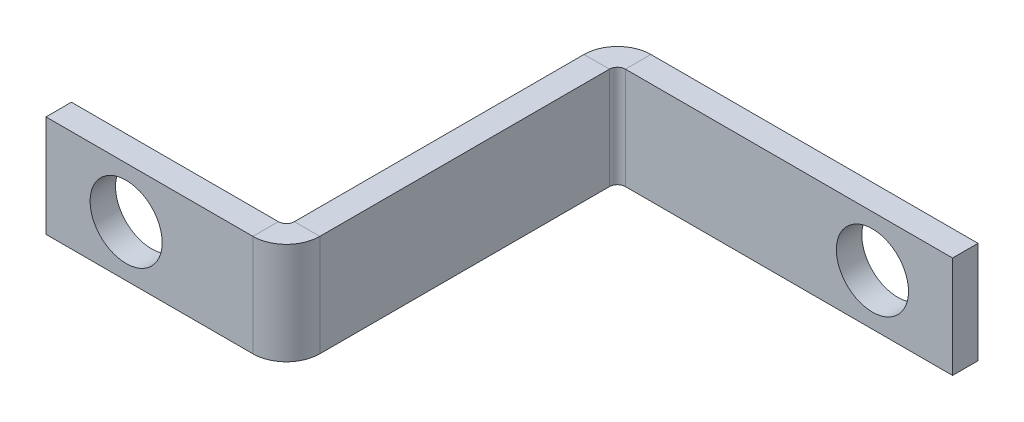
ISO-10303-21;
HEADER;
FILE_DESCRIPTION(('STEP AP214'),'2;1');
FILE_NAME('part.step','',(''),(''),'','','');
FILE_SCHEMA(('AUTOMOTIVE_DESIGN { 1 0 10303 214 1 1 1 1 }'));
ENDSEC;
DATA;
#1=APPLICATION_CONTEXT('core data for automotive mechanical design processes');
#2=APPLICATION_PROTOCOL_DEFINITION('international standard','automotive_design',2000,#1);
#3=PRODUCT_CONTEXT('',#1,'mechanical');
#4=PRODUCT('Part','Part','',(#3));
#5=PRODUCT_RELATED_PRODUCT_CATEGORY('part','',(#4));
#6=PRODUCT_DEFINITION_FORMATION('','',#4);
#7=PRODUCT_DEFINITION_CONTEXT('part definition',#1,'design');
#8=PRODUCT_DEFINITION('design','',#6,#7);
#9=PRODUCT_DEFINITION_SHAPE('','',#8);
#10=(LENGTH_UNIT() NAMED_UNIT(*) SI_UNIT(.MILLI.,.METRE.));
#11=(NAMED_UNIT(*) PLANE_ANGLE_UNIT() SI_UNIT($,.RADIAN.));
#12=(NAMED_UNIT(*) SI_UNIT($,.STERADIAN.) SOLID_ANGLE_UNIT());
#13=UNCERTAINTY_MEASURE_WITH_UNIT(LENGTH_MEASURE(1.E-05),#10,'distance_accuracy_value','');
#14=(GEOMETRIC_REPRESENTATION_CONTEXT(3) GLOBAL_UNCERTAINTY_ASSIGNED_CONTEXT((#13)) GLOBAL_UNIT_ASSIGNED_CONTEXT((#10,
#11,#12)) REPRESENTATION_CONTEXT('',''));
#15=CARTESIAN_POINT('',(0.,0.,0.));
#16=DIRECTION('',(0.,0.,1.));
#17=DIRECTION('',(1.,0.,0.));
#18=AXIS2_PLACEMENT_3D('',#15,#16,#17);
#19=CARTESIAN_POINT('',(30.0000000000001,0.,-41.32));
#20=DIRECTION('',(0.,1.,0.));
#21=DIRECTION('',(0.,0.,1.));
#22=AXIS2_PLACEMENT_3D('',#19,#20,#21);
#23=PLANE('',#22);
#24=DIRECTION('',(-1.,0.,0.));
#25=VECTOR('',#24,1.);
#26=CARTESIAN_POINT('',(30.0000000000001,0.,-37.145));
#27=LINE('',#26,#25);
#28=CARTESIAN_POINT('',(30.0000000000001,0.,-37.145));
#29=VERTEX_POINT('',#28);
#30=CARTESIAN_POINT('',(26.8250000000001,0.,-37.145));
#31=VERTEX_POINT('',#30);
#32=EDGE_CURVE('E228',#29,#31,#27,.T.);
#33=ORIENTED_EDGE('',*,*,#32,.F.);
#34=DIRECTION('',(0.,0.,-1.));
#35=VECTOR('',#34,1.);
#36=CARTESIAN_POINT('',(30.,0.,1.16881754302655E-13));
#37=LINE('',#36,#35);
#38=CARTESIAN_POINT('',(30.,0.,-0.999999999999986));
#39=VERTEX_POINT('',#38);
#40=EDGE_CURVE('E236',#39,#29,#37,.T.);
#41=ORIENTED_EDGE('',*,*,#40,.F.);
#42=DIRECTION('',(-1.,0.,0.));
#43=VECTOR('',#42,1.);
#44=CARTESIAN_POINT('',(26.825,0.,-0.999999999999997));
#45=LINE('',#44,#43);
#46=CARTESIAN_POINT('',(26.825,0.,-0.999999999999998));
#47=VERTEX_POINT('',#46);
#48=EDGE_CURVE('E247',#47,#39,#45,.F.);
#49=ORIENTED_EDGE('',*,*,#48,.F.);
#50=DIRECTION('',(0.,0.,1.));
#51=VECTOR('',#50,1.);
#52=CARTESIAN_POINT('',(26.8250000000001,0.,-41.32));
#53=LINE('',#52,#51);
#54=EDGE_CURVE('E241',#47,#31,#53,.F.);
#55=ORIENTED_EDGE('',*,*,#54,.T.);
#56=EDGE_LOOP('',(#33,#41,#49,#55));
#57=FACE_BOUND('',#56,.T.);
#58=ADVANCED_FACE('F78',(#57),#23,.F.);
#59=CARTESIAN_POINT('',(30.,12.7,0.));
#60=DIRECTION('',(0.,-1.,0.));
#61=DIRECTION('',(0.,0.,-1.));
#62=AXIS2_PLACEMENT_3D('',#59,#60,#61);
#63=PLANE('',#62);
#64=DIRECTION('',(-1.,0.,0.));
#65=VECTOR('',#64,1.);
#66=CARTESIAN_POINT('',(30.0000000000001,12.7,-37.145));
#67=LINE('',#66,#65);
#68=CARTESIAN_POINT('',(30.0000000000001,12.7,-37.145));
#69=VERTEX_POINT('',#68);
#70=CARTESIAN_POINT('',(26.8250000000001,12.7,-37.145));
#71=VERTEX_POINT('',#70);
#72=EDGE_CURVE('E217',#69,#71,#67,.T.);
#73=ORIENTED_EDGE('',*,*,#72,.T.);
#74=DIRECTION('',(0.,0.,-1.));
#75=VECTOR('',#74,1.);
#76=CARTESIAN_POINT('',(26.825,12.7,0.));
#77=LINE('',#76,#75);
#78=CARTESIAN_POINT('',(26.825,12.7,-0.999999999999998));
#79=VERTEX_POINT('',#78);
#80=EDGE_CURVE('E239',#71,#79,#77,.F.);
#81=ORIENTED_EDGE('',*,*,#80,.T.);
#82=DIRECTION('',(-1.,0.,0.));
#83=VECTOR('',#82,1.);
#84=CARTESIAN_POINT('',(30.,12.7,-0.999999999999986));
#85=LINE('',#84,#83);
#86=CARTESIAN_POINT('',(30.,12.7,-0.999999999999986));
#87=VERTEX_POINT('',#86);
#88=EDGE_CURVE('E230',#79,#87,#85,.F.);
#89=ORIENTED_EDGE('',*,*,#88,.T.);
#90=DIRECTION('',(0.,0.,1.));
#91=VECTOR('',#90,1.);
#92=CARTESIAN_POINT('',(30.,12.7,1.16881754302655E-13));
#93=LINE('',#92,#91);
#94=EDGE_CURVE('E233',#69,#87,#93,.T.);
#95=ORIENTED_EDGE('',*,*,#94,.F.);
#96=EDGE_LOOP('',(#73,#81,#89,#95));
#97=FACE_BOUND('',#96,.T.);
#98=ADVANCED_FACE('F328',(#97),#63,.F.);
#99=CARTESIAN_POINT('',(30.,0.,1.16881754302655E-13));
#100=DIRECTION('',(-1.,0.,0.));
#101=DIRECTION('',(0.,0.,1.));
#102=AXIS2_PLACEMENT_3D('',#99,#100,#101);
#103=PLANE('',#102);
#104=DIRECTION('',(0.,1.,0.));
#105=VECTOR('',#104,1.);
#106=CARTESIAN_POINT('',(30.0000000000001,12.7,-37.145));
#107=LINE('',#106,#105);
#108=EDGE_CURVE('E223',#69,#29,#107,.F.);
#109=ORIENTED_EDGE('',*,*,#108,.F.);
#110=ORIENTED_EDGE('',*,*,#94,.T.);
#111=DIRECTION('',(0.,-1.,0.));
#112=VECTOR('',#111,1.);
#113=CARTESIAN_POINT('',(30.,12.7,-0.999999999999986));
#114=LINE('',#113,#112);
#115=EDGE_CURVE('E244',#39,#87,#114,.F.);
#116=ORIENTED_EDGE('',*,*,#115,.F.);
#117=ORIENTED_EDGE('',*,*,#40,.T.);
#118=EDGE_LOOP('',(#109,#110,#116,#117));
#119=FACE_BOUND('',#118,.T.);
#120=ADVANCED_FACE('F318',(#119),#103,.F.);
#121=CARTESIAN_POINT('',(26.825,0.,1.05796301051828E-13));
#122=DIRECTION('',(-1.,0.,0.));
#123=DIRECTION('',(0.,0.,1.));
#124=AXIS2_PLACEMENT_3D('',#121,#122,#123);
#125=PLANE('',#124);
#126=ORIENTED_EDGE('',*,*,#80,.F.);
#127=DIRECTION('',(0.,1.,0.));
#128=VECTOR('',#127,1.);
#129=CARTESIAN_POINT('',(26.8250000000001,12.7,-37.145));
#130=LINE('',#129,#128);
#131=EDGE_CURVE('E212',#71,#31,#130,.F.);
#132=ORIENTED_EDGE('',*,*,#131,.T.);
#133=ORIENTED_EDGE('',*,*,#54,.F.);
#134=DIRECTION('',(0.,-1.,0.));
#135=VECTOR('',#134,1.);
#136=CARTESIAN_POINT('',(26.825,12.7,-0.999999999999997));
#137=LINE('',#136,#135);
#138=EDGE_CURVE('E250',#79,#47,#137,.T.);
#139=ORIENTED_EDGE('',*,*,#138,.F.);
#140=EDGE_LOOP('',(#126,#132,#133,#139));
#141=FACE_BOUND('',#140,.T.);
#142=ADVANCED_FACE('F311',(#141),#125,.T.);
#143=CARTESIAN_POINT('',(0.,0.,0.));
#144=DIRECTION('',(0.,1.,0.));
#145=DIRECTION('',(1.,0.,0.));
#146=AXIS2_PLACEMENT_3D('',#143,#144,#145);
#147=PLANE('',#146);
#148=DIRECTION('',(1.,0.,0.));
#149=VECTOR('',#148,1.);
#150=CARTESIAN_POINT('',(0.,0.,0.));
#151=LINE('',#150,#149);
#152=CARTESIAN_POINT('',(0.,0.,0.));
#153=VERTEX_POINT('',#152);
#154=CARTESIAN_POINT('',(25.825,0.,0.));
#155=VERTEX_POINT('',#154);
#156=EDGE_CURVE('E280',#153,#155,#151,.T.);
#157=ORIENTED_EDGE('',*,*,#156,.T.);
#158=DIRECTION('',(0.,0.,1.));
#159=VECTOR('',#158,1.);
#160=CARTESIAN_POINT('',(25.825,0.,0.));
#161=LINE('',#160,#159);
#162=CARTESIAN_POINT('',(25.825,0.,3.175));
#163=VERTEX_POINT('',#162);
#164=EDGE_CURVE('E260',#155,#163,#161,.T.);
#165=ORIENTED_EDGE('',*,*,#164,.T.);
#166=DIRECTION('',(-1.,0.,0.));
#167=VECTOR('',#166,1.);
#168=CARTESIAN_POINT('',(0.,0.,3.175));
#169=LINE('',#168,#167);
#170=CARTESIAN_POINT('',(0.,0.,3.175));
#171=VERTEX_POINT('',#170);
#172=EDGE_CURVE('E278',#171,#163,#169,.F.);
#173=ORIENTED_EDGE('',*,*,#172,.F.);
#174=DIRECTION('',(0.,0.,-1.));
#175=VECTOR('',#174,1.);
#176=CARTESIAN_POINT('',(0.,0.,0.));
#177=LINE('',#176,#175);
#178=EDGE_CURVE('E13',#171,#153,#177,.T.);
#179=ORIENTED_EDGE('',*,*,#178,.T.);
#180=EDGE_LOOP('',(#157,#165,#173,#179));
#181=FACE_BOUND('',#180,.T.);
#182=ADVANCED_FACE('F298',(#181),#147,.F.);
#183=CARTESIAN_POINT('',(0.,0.,0.));
#184=DIRECTION('',(0.,0.,-1.));
#185=DIRECTION('',(-1.,0.,0.));
#186=AXIS2_PLACEMENT_3D('',#183,#184,#185);
#187=PLANE('',#186);
#188=CARTESIAN_POINT('',(10.,6.35,0.));
#189=DIRECTION('',(0.,0.,-1.));
#190=DIRECTION('',(-1.,0.,0.));
#191=AXIS2_PLACEMENT_3D('',#188,#189,#190);
#192=CIRCLE('',#191,4.49999999999999);
#193=CARTESIAN_POINT('',(5.50000000000001,6.35,0.));
#194=VERTEX_POINT('',#193);
#195=EDGE_CURVE('E211',#194,#194,#192,.T.);
#196=ORIENTED_EDGE('',*,*,#195,.F.);
#197=EDGE_LOOP('',(#196));
#198=FACE_BOUND('',#197,.T.);
#199=DIRECTION('',(-1.,0.,0.));
#200=VECTOR('',#199,1.);
#201=CARTESIAN_POINT('',(0.,12.7,0.));
#202=LINE('',#201,#200);
#203=CARTESIAN_POINT('',(25.825,12.7,0.));
#204=VERTEX_POINT('',#203);
#205=CARTESIAN_POINT('',(0.,12.7,0.));
#206=VERTEX_POINT('',#205);
#207=EDGE_CURVE('E277',#204,#206,#202,.T.);
#208=ORIENTED_EDGE('',*,*,#207,.F.);
#209=DIRECTION('',(0.,-1.,0.));
#210=VECTOR('',#209,1.);
#211=CARTESIAN_POINT('',(25.825,0.,0.));
#212=LINE('',#211,#210);
#213=EDGE_CURVE('E103',#155,#204,#212,.F.);
#214=ORIENTED_EDGE('',*,*,#213,.F.);
#215=ORIENTED_EDGE('',*,*,#156,.F.);
#216=DIRECTION('',(0.,-1.,0.));
#217=VECTOR('',#216,1.);
#218=CARTESIAN_POINT('',(0.,0.,0.));
#219=LINE('',#218,#217);
#220=EDGE_CURVE('E274',#206,#153,#219,.T.);
#221=ORIENTED_EDGE('',*,*,#220,.F.);
#222=EDGE_LOOP('',(#208,#214,#215,#221));
#223=FACE_BOUND('',#222,.T.);
#224=ADVANCED_FACE('F295',(#198,#223),#187,.T.);
#225=CARTESIAN_POINT('',(0.,0.,3.175));
#226=DIRECTION('',(0.,0.,-1.));
#227=DIRECTION('',(-1.,0.,0.));
#228=AXIS2_PLACEMENT_3D('',#225,#226,#227);
#229=PLANE('',#228);
#230=CARTESIAN_POINT('',(10.,6.35,3.175));
#231=DIRECTION('',(0.,0.,-1.));
#232=DIRECTION('',(-1.,0.,0.));
#233=AXIS2_PLACEMENT_3D('',#230,#231,#232);
#234=CIRCLE('',#233,4.49999999999999);
#235=CARTESIAN_POINT('',(5.50000000000001,6.35,3.175));
#236=VERTEX_POINT('',#235);
#237=EDGE_CURVE('E346',#236,#236,#234,.T.);
#238=ORIENTED_EDGE('',*,*,#237,.T.);
#239=EDGE_LOOP('',(#238));
#240=FACE_BOUND('',#239,.T.);
#241=DIRECTION('',(0.,-1.,0.));
#242=VECTOR('',#241,1.);
#243=CARTESIAN_POINT('',(25.825,0.,3.175));
#244=LINE('',#243,#242);
#245=CARTESIAN_POINT('',(25.825,12.7,3.175));
#246=VERTEX_POINT('',#245);
#247=EDGE_CURVE('E254',#163,#246,#244,.F.);
#248=ORIENTED_EDGE('',*,*,#247,.T.);
#249=DIRECTION('',(-1.,0.,0.));
#250=VECTOR('',#249,1.);
#251=CARTESIAN_POINT('',(0.,12.7,3.175));
#252=LINE('',#251,#250);
#253=CARTESIAN_POINT('',(0.,12.7,3.175));
#254=VERTEX_POINT('',#253);
#255=EDGE_CURVE('E284',#246,#254,#252,.T.);
#256=ORIENTED_EDGE('',*,*,#255,.T.);
#257=DIRECTION('',(0.,1.,0.));
#258=VECTOR('',#257,1.);
#259=CARTESIAN_POINT('',(0.,0.,3.175));
#260=LINE('',#259,#258);
#261=EDGE_CURVE('E272',#254,#171,#260,.F.);
#262=ORIENTED_EDGE('',*,*,#261,.T.);
#263=ORIENTED_EDGE('',*,*,#172,.T.);
#264=EDGE_LOOP('',(#248,#256,#262,#263));
#265=FACE_BOUND('',#264,.T.);
#266=ADVANCED_FACE('F387',(#240,#265),#229,.F.);
#267=CARTESIAN_POINT('',(0.,0.,0.));
#268=DIRECTION('',(1.,0.,0.));
#269=DIRECTION('',(0.,-1.,0.));
#270=AXIS2_PLACEMENT_3D('',#267,#268,#269);
#271=PLANE('',#270);
#272=ORIENTED_EDGE('',*,*,#178,.F.);
#273=ORIENTED_EDGE('',*,*,#261,.F.);
#274=DIRECTION('',(0.,0.,-1.));
#275=VECTOR('',#274,1.);
#276=CARTESIAN_POINT('',(0.,12.7,0.));
#277=LINE('',#276,#275);
#278=EDGE_CURVE('E87',#254,#206,#277,.T.);
#279=ORIENTED_EDGE('',*,*,#278,.T.);
#280=ORIENTED_EDGE('',*,*,#220,.T.);
#281=EDGE_LOOP('',(#272,#273,#279,#280));
#282=FACE_BOUND('',#281,.T.);
#283=ADVANCED_FACE('F292',(#282),#271,.F.);
#284=CARTESIAN_POINT('',(0.,12.7,0.));
#285=DIRECTION('',(0.,-1.,0.));
#286=DIRECTION('',(-1.,0.,0.));
#287=AXIS2_PLACEMENT_3D('',#284,#285,#286);
#288=PLANE('',#287);
#289=DIRECTION('',(0.,0.,1.));
#290=VECTOR('',#289,1.);
#291=CARTESIAN_POINT('',(25.825,12.7,0.));
#292=LINE('',#291,#290);
#293=EDGE_CURVE('E269',#204,#246,#292,.T.);
#294=ORIENTED_EDGE('',*,*,#293,.F.);
#295=ORIENTED_EDGE('',*,*,#207,.T.);
#296=ORIENTED_EDGE('',*,*,#278,.F.);
#297=ORIENTED_EDGE('',*,*,#255,.F.);
#298=EDGE_LOOP('',(#294,#295,#296,#297));
#299=FACE_BOUND('',#298,.T.);
#300=ADVANCED_FACE('F80',(#299),#288,.F.);
#301=CARTESIAN_POINT('',(25.825,12.7,-1.));
#302=DIRECTION('',(0.,1.,0.));
#303=DIRECTION('',(0.,0.,1.));
#304=AXIS2_PLACEMENT_3D('',#301,#302,#303);
#305=PLANE('',#304);
#306=ORIENTED_EDGE('',*,*,#88,.F.);
#307=CARTESIAN_POINT('',(25.825,12.7,-1.));
#308=DIRECTION('',(0.,-1.,0.));
#309=DIRECTION('',(0.,0.,-1.));
#310=AXIS2_PLACEMENT_3D('',#307,#308,#309);
#311=CIRCLE('',#310,1.);
#312=EDGE_CURVE('E263',#204,#79,#311,.F.);
#313=ORIENTED_EDGE('',*,*,#312,.F.);
#314=ORIENTED_EDGE('',*,*,#293,.T.);
#315=CARTESIAN_POINT('',(25.825,12.7,-1.));
#316=DIRECTION('',(0.,-1.,0.));
#317=DIRECTION('',(0.,0.,-1.));
#318=AXIS2_PLACEMENT_3D('',#315,#316,#317);
#319=CIRCLE('',#318,4.175);
#320=EDGE_CURVE('E256',#246,#87,#319,.F.);
#321=ORIENTED_EDGE('',*,*,#320,.T.);
#322=EDGE_LOOP('',(#306,#313,#314,#321));
#323=FACE_BOUND('',#322,.T.);
#324=ADVANCED_FACE('F326',(#323),#305,.T.);
#325=CARTESIAN_POINT('',(25.825,0.,-1.));
#326=DIRECTION('',(0.,1.,0.));
#327=DIRECTION('',(0.,0.,1.));
#328=AXIS2_PLACEMENT_3D('',#325,#326,#327);
#329=PLANE('',#328);
#330=CARTESIAN_POINT('',(25.825,0.,-1.));
#331=DIRECTION('',(0.,-1.,0.));
#332=DIRECTION('',(0.,0.,-1.));
#333=AXIS2_PLACEMENT_3D('',#330,#331,#332);
#334=CIRCLE('',#333,1.);
#335=EDGE_CURVE('E235',#47,#155,#334,.T.);
#336=ORIENTED_EDGE('',*,*,#335,.F.);
#337=ORIENTED_EDGE('',*,*,#48,.T.);
#338=CARTESIAN_POINT('',(25.825,0.,-1.));
#339=DIRECTION('',(0.,-1.,0.));
#340=DIRECTION('',(0.,0.,-1.));
#341=AXIS2_PLACEMENT_3D('',#338,#339,#340);
#342=CIRCLE('',#341,4.175);
#343=EDGE_CURVE('E257',#39,#163,#342,.T.);
#344=ORIENTED_EDGE('',*,*,#343,.T.);
#345=ORIENTED_EDGE('',*,*,#164,.F.);
#346=EDGE_LOOP('',(#336,#337,#344,#345));
#347=FACE_BOUND('',#346,.T.);
#348=ADVANCED_FACE('F302',(#347),#329,.F.);
#349=CARTESIAN_POINT('',(25.825,0.,-1.));
#350=DIRECTION('',(0.,-1.,0.));
#351=DIRECTION('',(1.,0.,0.));
#352=AXIS2_PLACEMENT_3D('',#349,#350,#351);
#353=CYLINDRICAL_SURFACE('',#352,4.175);
#354=ORIENTED_EDGE('',*,*,#247,.F.);
#355=ORIENTED_EDGE('',*,*,#343,.F.);
#356=ORIENTED_EDGE('',*,*,#115,.T.);
#357=ORIENTED_EDGE('',*,*,#320,.F.);
#358=EDGE_LOOP('',(#354,#355,#356,#357));
#359=FACE_BOUND('',#358,.T.);
#360=ADVANCED_FACE('F323',(#359),#353,.T.);
#361=CARTESIAN_POINT('',(25.825,0.,-1.));
#362=DIRECTION('',(0.,-1.,0.));
#363=DIRECTION('',(1.,0.,0.));
#364=AXIS2_PLACEMENT_3D('',#361,#362,#363);
#365=CYLINDRICAL_SURFACE('',#364,1.);
#366=ORIENTED_EDGE('',*,*,#213,.T.);
#367=ORIENTED_EDGE('',*,*,#312,.T.);
#368=ORIENTED_EDGE('',*,*,#138,.T.);
#369=ORIENTED_EDGE('',*,*,#335,.T.);
#370=EDGE_LOOP('',(#366,#367,#368,#369));
#371=FACE_BOUND('',#370,.T.);
#372=ADVANCED_FACE('F305',(#371),#365,.F.);
#373=CARTESIAN_POINT('',(31.0000000000001,0.,-37.145));
#374=DIRECTION('',(0.,-1.,0.));
#375=DIRECTION('',(0.,0.,-1.));
#376=AXIS2_PLACEMENT_3D('',#373,#374,#375);
#377=PLANE('',#376);
#378=DIRECTION('',(0.,0.,1.));
#379=VECTOR('',#378,1.);
#380=CARTESIAN_POINT('',(31.0000000000001,0.,-41.32));
#381=LINE('',#380,#379);
#382=CARTESIAN_POINT('',(31.0000000000001,0.,-38.145));
#383=VERTEX_POINT('',#382);
#384=CARTESIAN_POINT('',(31.0000000000001,0.,-41.32));
#385=VERTEX_POINT('',#384);
#386=EDGE_CURVE('E194',#383,#385,#381,.F.);
#387=ORIENTED_EDGE('',*,*,#386,.F.);
#388=CARTESIAN_POINT('',(31.0000000000001,0.,-37.145));
#389=DIRECTION('',(0.,1.,0.));
#390=DIRECTION('',(0.,0.,1.));
#391=AXIS2_PLACEMENT_3D('',#388,#389,#390);
#392=CIRCLE('',#391,1.);
#393=EDGE_CURVE('E220',#29,#383,#392,.F.);
#394=ORIENTED_EDGE('',*,*,#393,.F.);
#395=ORIENTED_EDGE('',*,*,#32,.T.);
#396=CARTESIAN_POINT('',(31.0000000000001,0.,-37.145));
#397=DIRECTION('',(0.,1.,0.));
#398=DIRECTION('',(0.,0.,1.));
#399=AXIS2_PLACEMENT_3D('',#396,#397,#398);
#400=CIRCLE('',#399,4.175);
#401=EDGE_CURVE('E95',#31,#385,#400,.F.);
#402=ORIENTED_EDGE('',*,*,#401,.T.);
#403=EDGE_LOOP('',(#387,#394,#395,#402));
#404=FACE_BOUND('',#403,.T.);
#405=ADVANCED_FACE('F380',(#404),#377,.T.);
#406=CARTESIAN_POINT('',(31.0000000000001,12.7,-37.145));
#407=DIRECTION('',(0.,-1.,0.));
#408=DIRECTION('',(0.,0.,-1.));
#409=AXIS2_PLACEMENT_3D('',#406,#407,#408);
#410=PLANE('',#409);
#411=CARTESIAN_POINT('',(31.0000000000001,12.7,-37.145));
#412=DIRECTION('',(0.,1.,0.));
#413=DIRECTION('',(0.,0.,1.));
#414=AXIS2_PLACEMENT_3D('',#411,#412,#413);
#415=CIRCLE('',#414,1.);
#416=CARTESIAN_POINT('',(31.0000000000001,12.7,-38.145));
#417=VERTEX_POINT('',#416);
#418=EDGE_CURVE('E225',#417,#69,#415,.T.);
#419=ORIENTED_EDGE('',*,*,#418,.F.);
#420=DIRECTION('',(0.,0.,1.));
#421=VECTOR('',#420,1.);
#422=CARTESIAN_POINT('',(31.0000000000001,12.7,-38.145));
#423=LINE('',#422,#421);
#424=CARTESIAN_POINT('',(31.0000000000001,12.7,-41.32));
#425=VERTEX_POINT('',#424);
#426=EDGE_CURVE('E205',#417,#425,#423,.F.);
#427=ORIENTED_EDGE('',*,*,#426,.T.);
#428=CARTESIAN_POINT('',(31.0000000000001,12.7,-37.145));
#429=DIRECTION('',(0.,1.,0.));
#430=DIRECTION('',(0.,0.,1.));
#431=AXIS2_PLACEMENT_3D('',#428,#429,#430);
#432=CIRCLE('',#431,4.175);
#433=EDGE_CURVE('E215',#425,#71,#432,.T.);
#434=ORIENTED_EDGE('',*,*,#433,.T.);
#435=ORIENTED_EDGE('',*,*,#72,.F.);
#436=EDGE_LOOP('',(#419,#427,#434,#435));
#437=FACE_BOUND('',#436,.T.);
#438=ADVANCED_FACE('F331',(#437),#410,.F.);
#439=CARTESIAN_POINT('',(31.0000000000001,12.7,-37.145));
#440=DIRECTION('',(0.,1.,0.));
#441=DIRECTION('',(0.,0.,-1.));
#442=AXIS2_PLACEMENT_3D('',#439,#440,#441);
#443=CYLINDRICAL_SURFACE('',#442,4.175);
#444=ORIENTED_EDGE('',*,*,#131,.F.);
#445=ORIENTED_EDGE('',*,*,#433,.F.);
#446=DIRECTION('',(0.,1.,0.));
#447=VECTOR('',#446,1.);
#448=CARTESIAN_POINT('',(31.0000000000001,0.,-41.32));
#449=LINE('',#448,#447);
#450=EDGE_CURVE('E203',#425,#385,#449,.F.);
#451=ORIENTED_EDGE('',*,*,#450,.T.);
#452=ORIENTED_EDGE('',*,*,#401,.F.);
#453=EDGE_LOOP('',(#444,#445,#451,#452));
#454=FACE_BOUND('',#453,.T.);
#455=ADVANCED_FACE('F404',(#454),#443,.T.);
#456=CARTESIAN_POINT('',(31.0000000000001,12.7,-37.145));
#457=DIRECTION('',(0.,1.,0.));
#458=DIRECTION('',(0.,0.,-1.));
#459=AXIS2_PLACEMENT_3D('',#456,#457,#458);
#460=CYLINDRICAL_SURFACE('',#459,1.);
#461=ORIENTED_EDGE('',*,*,#108,.T.);
#462=ORIENTED_EDGE('',*,*,#393,.T.);
#463=DIRECTION('',(0.,1.,0.));
#464=VECTOR('',#463,1.);
#465=CARTESIAN_POINT('',(31.0000000000001,0.,-38.145));
#466=LINE('',#465,#464);
#467=EDGE_CURVE('E208',#383,#417,#466,.T.);
#468=ORIENTED_EDGE('',*,*,#467,.T.);
#469=ORIENTED_EDGE('',*,*,#418,.T.);
#470=EDGE_LOOP('',(#461,#462,#468,#469));
#471=FACE_BOUND('',#470,.T.);
#472=ADVANCED_FACE('F334',(#471),#460,.F.);
#473=CARTESIAN_POINT('',(30.0000000000001,0.,-41.32));
#474=DIRECTION('',(0.,1.,0.));
#475=DIRECTION('',(0.,0.,1.));
#476=AXIS2_PLACEMENT_3D('',#473,#474,#475);
#477=PLANE('',#476);
#478=ORIENTED_EDGE('',*,*,#386,.T.);
#479=DIRECTION('',(-1.,0.,0.));
#480=VECTOR('',#479,1.);
#481=CARTESIAN_POINT('',(0.,0.,-41.32));
#482=LINE('',#481,#480);
#483=CARTESIAN_POINT('',(71.8250000000001,0.,-41.32));
#484=VERTEX_POINT('',#483);
#485=EDGE_CURVE('E175',#484,#385,#482,.T.);
#486=ORIENTED_EDGE('',*,*,#485,.F.);
#487=DIRECTION('',(0.,0.,1.));
#488=VECTOR('',#487,1.);
#489=CARTESIAN_POINT('',(71.8250000000001,0.,-41.32));
#490=LINE('',#489,#488);
#491=CARTESIAN_POINT('',(71.8250000000001,0.,-38.145));
#492=VERTEX_POINT('',#491);
#493=EDGE_CURVE('E181',#484,#492,#490,.T.);
#494=ORIENTED_EDGE('',*,*,#493,.T.);
#495=DIRECTION('',(1.,0.,0.));
#496=VECTOR('',#495,1.);
#497=CARTESIAN_POINT('',(30.0000000000001,0.,-38.145));
#498=LINE('',#497,#496);
#499=EDGE_CURVE('E201',#492,#383,#498,.F.);
#500=ORIENTED_EDGE('',*,*,#499,.T.);
#501=EDGE_LOOP('',(#478,#486,#494,#500));
#502=FACE_BOUND('',#501,.T.);
#503=ADVANCED_FACE('F193',(#502),#477,.F.);
#504=CARTESIAN_POINT('',(71.8250000000001,12.7,-41.32));
#505=DIRECTION('',(0.,-1.,0.));
#506=DIRECTION('',(0.,0.,-1.));
#507=AXIS2_PLACEMENT_3D('',#504,#505,#506);
#508=PLANE('',#507);
#509=ORIENTED_EDGE('',*,*,#426,.F.);
#510=DIRECTION('',(-1.,0.,0.));
#511=VECTOR('',#510,1.);
#512=CARTESIAN_POINT('',(71.8250000000001,12.7,-38.145));
#513=LINE('',#512,#511);
#514=CARTESIAN_POINT('',(71.8250000000001,12.7,-38.145));
#515=VERTEX_POINT('',#514);
#516=EDGE_CURVE('E197',#417,#515,#513,.F.);
#517=ORIENTED_EDGE('',*,*,#516,.T.);
#518=DIRECTION('',(0.,0.,1.));
#519=VECTOR('',#518,1.);
#520=CARTESIAN_POINT('',(71.8250000000001,12.7,-41.32));
#521=LINE('',#520,#519);
#522=CARTESIAN_POINT('',(71.8250000000001,12.7,-41.32));
#523=VERTEX_POINT('',#522);
#524=EDGE_CURVE('E190',#523,#515,#521,.T.);
#525=ORIENTED_EDGE('',*,*,#524,.F.);
#526=DIRECTION('',(1.,0.,0.));
#527=VECTOR('',#526,1.);
#528=CARTESIAN_POINT('',(0.,12.7,-41.32));
#529=LINE('',#528,#527);
#530=EDGE_CURVE('E177',#425,#523,#529,.T.);
#531=ORIENTED_EDGE('',*,*,#530,.F.);
#532=EDGE_LOOP('',(#509,#517,#525,#531));
#533=FACE_BOUND('',#532,.T.);
#534=ADVANCED_FACE('F341',(#533),#508,.F.);
#535=CARTESIAN_POINT('',(0.,0.,-41.32));
#536=DIRECTION('',(0.,0.,1.));
#537=DIRECTION('',(1.,0.,0.));
#538=AXIS2_PLACEMENT_3D('',#535,#536,#537);
#539=PLANE('',#538);
#540=CARTESIAN_POINT('',(61.8250000000001,6.35,-41.32));
#541=DIRECTION('',(0.,0.,-1.));
#542=DIRECTION('',(-1.,0.,0.));
#543=AXIS2_PLACEMENT_3D('',#540,#541,#542);
#544=CIRCLE('',#543,4.49999999999998);
#545=CARTESIAN_POINT('',(57.3250000000002,6.35,-41.32));
#546=VERTEX_POINT('',#545);
#547=EDGE_CURVE('E349',#546,#546,#544,.T.);
#548=ORIENTED_EDGE('',*,*,#547,.F.);
#549=EDGE_LOOP('',(#548));
#550=FACE_BOUND('',#549,.T.);
#551=ORIENTED_EDGE('',*,*,#450,.F.);
#552=ORIENTED_EDGE('',*,*,#530,.T.);
#553=DIRECTION('',(0.,-1.,0.));
#554=VECTOR('',#553,1.);
#555=CARTESIAN_POINT('',(71.8250000000001,0.,-41.32));
#556=LINE('',#555,#554);
#557=EDGE_CURVE('E170',#523,#484,#556,.T.);
#558=ORIENTED_EDGE('',*,*,#557,.T.);
#559=ORIENTED_EDGE('',*,*,#485,.T.);
#560=EDGE_LOOP('',(#551,#552,#558,#559));
#561=FACE_BOUND('',#560,.T.);
#562=ADVANCED_FACE('F173',(#550,#561),#539,.F.);
#563=CARTESIAN_POINT('',(0.,0.,-38.145));
#564=DIRECTION('',(0.,0.,1.));
#565=DIRECTION('',(1.,0.,0.));
#566=AXIS2_PLACEMENT_3D('',#563,#564,#565);
#567=PLANE('',#566);
#568=CARTESIAN_POINT('',(61.8250000000001,6.35,-38.145));
#569=DIRECTION('',(0.,0.,1.));
#570=DIRECTION('',(1.,0.,0.));
#571=AXIS2_PLACEMENT_3D('',#568,#569,#570);
#572=CIRCLE('',#571,4.49999999999999);
#573=CARTESIAN_POINT('',(66.3250000000001,6.35,-38.145));
#574=VERTEX_POINT('',#573);
#575=EDGE_CURVE('E82',#574,#574,#572,.T.);
#576=ORIENTED_EDGE('',*,*,#575,.F.);
#577=EDGE_LOOP('',(#576));
#578=FACE_BOUND('',#577,.T.);
#579=ORIENTED_EDGE('',*,*,#516,.F.);
#580=ORIENTED_EDGE('',*,*,#467,.F.);
#581=ORIENTED_EDGE('',*,*,#499,.F.);
#582=DIRECTION('',(0.,1.,0.));
#583=VECTOR('',#582,1.);
#584=CARTESIAN_POINT('',(71.8250000000001,0.,-38.145));
#585=LINE('',#584,#583);
#586=EDGE_CURVE('E186',#515,#492,#585,.F.);
#587=ORIENTED_EDGE('',*,*,#586,.F.);
#588=EDGE_LOOP('',(#579,#580,#581,#587));
#589=FACE_BOUND('',#588,.T.);
#590=ADVANCED_FACE('F339',(#578,#589),#567,.T.);
#591=CARTESIAN_POINT('',(71.8250000000001,0.,-41.32));
#592=DIRECTION('',(-1.,0.,0.));
#593=DIRECTION('',(0.,0.,1.));
#594=AXIS2_PLACEMENT_3D('',#591,#592,#593);
#595=PLANE('',#594);
#596=ORIENTED_EDGE('',*,*,#586,.T.);
#597=ORIENTED_EDGE('',*,*,#493,.F.);
#598=ORIENTED_EDGE('',*,*,#557,.F.);
#599=ORIENTED_EDGE('',*,*,#524,.T.);
#600=EDGE_LOOP('',(#596,#597,#598,#599));
#601=FACE_BOUND('',#600,.T.);
#602=ADVANCED_FACE('F184',(#601),#595,.F.);
#603=CARTESIAN_POINT('',(10.,6.35,-41.32));
#604=DIRECTION('',(0.,0.,-1.));
#605=DIRECTION('',(-1.,0.,0.));
#606=AXIS2_PLACEMENT_3D('',#603,#604,#605);
#607=CYLINDRICAL_SURFACE('',#606,4.49999999999999);
#608=ORIENTED_EDGE('',*,*,#195,.T.);
#609=EDGE_LOOP('',(#608));
#610=FACE_BOUND('',#609,.T.);
#611=ORIENTED_EDGE('',*,*,#237,.F.);
#612=EDGE_LOOP('',(#611));
#613=FACE_BOUND('',#612,.T.);
#614=ADVANCED_FACE('F364',(#610,#613),#607,.F.);
#615=CARTESIAN_POINT('',(61.8250000000001,6.35,-41.32));
#616=DIRECTION('',(0.,0.,-1.));
#617=DIRECTION('',(-1.,0.,0.));
#618=AXIS2_PLACEMENT_3D('',#615,#616,#617);
#619=CYLINDRICAL_SURFACE('',#618,4.49999999999999);
#620=ORIENTED_EDGE('',*,*,#575,.T.);
#621=EDGE_LOOP('',(#620));
#622=FACE_BOUND('',#621,.T.);
#623=ORIENTED_EDGE('',*,*,#547,.T.);
#624=EDGE_LOOP('',(#623));
#625=FACE_BOUND('',#624,.T.);
#626=ADVANCED_FACE('F356',(#622,#625),#619,.F.);
#627=CLOSED_SHELL('',(#58,#98,#120,#142,#182,#224,#266,#283,#300,#324,#348,#360,#372,#405,#438,
#455,#472,#503,#534,#562,#590,#602,#614,#626));
#628=MANIFOLD_SOLID_BREP('B2',#627);
#629=ADVANCED_BREP_SHAPE_REPRESENTATION('',(#18,#628),#14);
#630=SHAPE_DEFINITION_REPRESENTATION(#9,#629);
ENDSEC;
END-ISO-10303-21;
